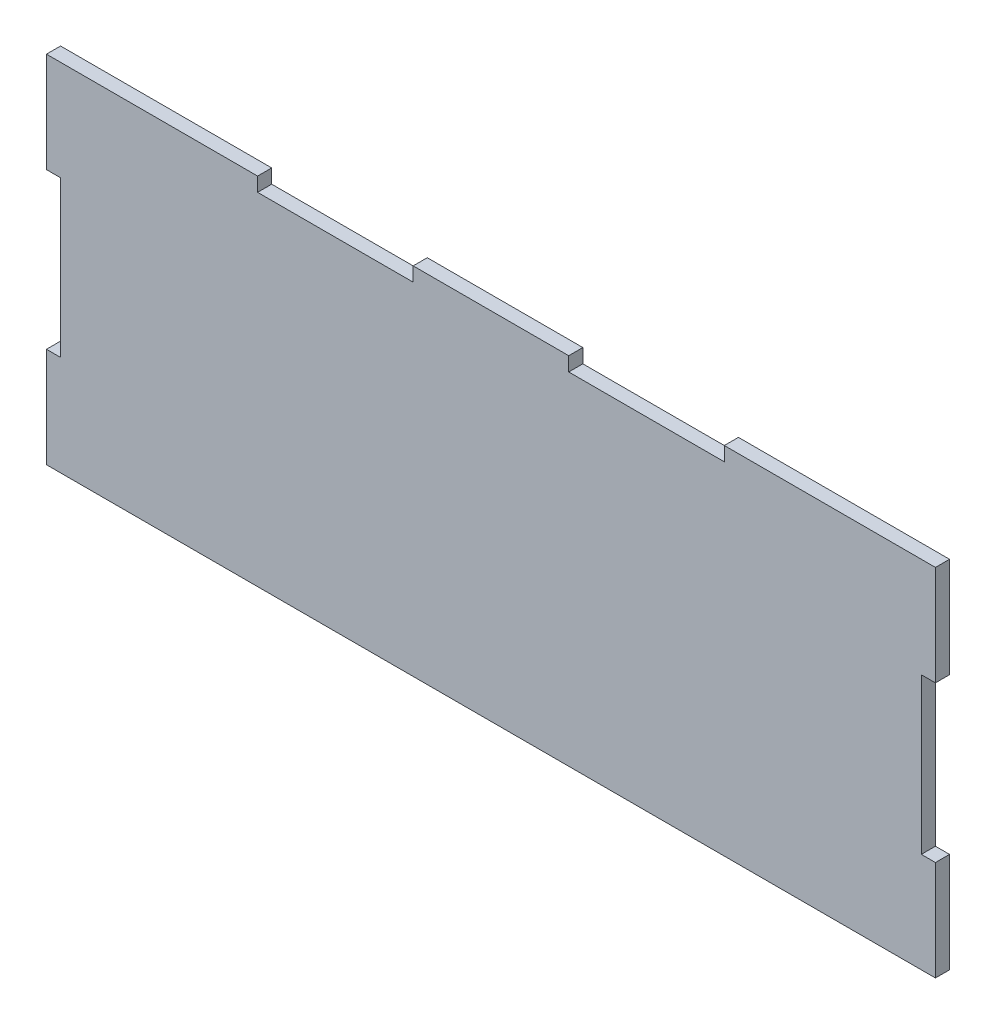
ISO-10303-21;
HEADER;
FILE_DESCRIPTION(('STEP AP214'),'2;1');
FILE_NAME('part.step','',(''),(''),'','','');
FILE_SCHEMA(('AUTOMOTIVE_DESIGN { 1 0 10303 214 1 1 1 1 }'));
ENDSEC;
DATA;
#1=APPLICATION_CONTEXT('core data for automotive mechanical design processes');
#2=APPLICATION_PROTOCOL_DEFINITION('international standard','automotive_design',2000,#1);
#3=PRODUCT_CONTEXT('',#1,'mechanical');
#4=PRODUCT('Part','Part','',(#3));
#5=PRODUCT_RELATED_PRODUCT_CATEGORY('part','',(#4));
#6=PRODUCT_DEFINITION_FORMATION('','',#4);
#7=PRODUCT_DEFINITION_CONTEXT('part definition',#1,'design');
#8=PRODUCT_DEFINITION('design','',#6,#7);
#9=PRODUCT_DEFINITION_SHAPE('','',#8);
#10=(LENGTH_UNIT() NAMED_UNIT(*) SI_UNIT(.MILLI.,.METRE.));
#11=(NAMED_UNIT(*) PLANE_ANGLE_UNIT() SI_UNIT($,.RADIAN.));
#12=(NAMED_UNIT(*) SI_UNIT($,.STERADIAN.) SOLID_ANGLE_UNIT());
#13=UNCERTAINTY_MEASURE_WITH_UNIT(LENGTH_MEASURE(1.E-05),#10,'distance_accuracy_value','');
#14=(GEOMETRIC_REPRESENTATION_CONTEXT(3) GLOBAL_UNCERTAINTY_ASSIGNED_CONTEXT((#13)) GLOBAL_UNIT_ASSIGNED_CONTEXT((#10,
#11,#12)) REPRESENTATION_CONTEXT('',''));
#15=CARTESIAN_POINT('',(0.,0.,0.));
#16=DIRECTION('',(0.,0.,1.));
#17=DIRECTION('',(1.,0.,0.));
#18=AXIS2_PLACEMENT_3D('',#15,#16,#17);
#19=CARTESIAN_POINT('',(100.,40.,3.175));
#20=DIRECTION('',(-1.,0.,0.));
#21=DIRECTION('',(0.,0.,1.));
#22=AXIS2_PLACEMENT_3D('',#19,#20,#21);
#23=PLANE('',#22);
#24=DIRECTION('',(0.,0.,1.));
#25=VECTOR('',#24,1.);
#26=CARTESIAN_POINT('',(100.,-17.5,0.));
#27=LINE('',#26,#25);
#28=CARTESIAN_POINT('',(100.,-17.5,0.));
#29=VERTEX_POINT('',#28);
#30=CARTESIAN_POINT('',(100.,-17.5,3.175));
#31=VERTEX_POINT('',#30);
#32=EDGE_CURVE('E254',#29,#31,#27,.T.);
#33=ORIENTED_EDGE('',*,*,#32,.T.);
#34=DIRECTION('',(0.,1.,0.));
#35=VECTOR('',#34,1.);
#36=CARTESIAN_POINT('',(100.,40.,3.175));
#37=LINE('',#36,#35);
#38=CARTESIAN_POINT('',(100.,-40.,3.175));
#39=VERTEX_POINT('',#38);
#40=EDGE_CURVE('E232',#39,#31,#37,.T.);
#41=ORIENTED_EDGE('',*,*,#40,.F.);
#42=DIRECTION('',(0.,0.,-1.));
#43=VECTOR('',#42,1.);
#44=CARTESIAN_POINT('',(100.,-40.,3.175));
#45=LINE('',#44,#43);
#46=CARTESIAN_POINT('',(100.,-40.,0.));
#47=VERTEX_POINT('',#46);
#48=EDGE_CURVE('E46',#39,#47,#45,.T.);
#49=ORIENTED_EDGE('',*,*,#48,.T.);
#50=DIRECTION('',(0.,1.,0.));
#51=VECTOR('',#50,1.);
#52=CARTESIAN_POINT('',(100.,40.,0.));
#53=LINE('',#52,#51);
#54=EDGE_CURVE('E202',#47,#29,#53,.T.);
#55=ORIENTED_EDGE('',*,*,#54,.T.);
#56=EDGE_LOOP('',(#33,#41,#49,#55));
#57=FACE_BOUND('',#56,.T.);
#58=ADVANCED_FACE('F37',(#57),#23,.F.);
#59=DIRECTION('',(0.,0.,1.));
#60=VECTOR('',#59,1.);
#61=CARTESIAN_POINT('',(100.,17.5,0.));
#62=LINE('',#61,#60);
#63=CARTESIAN_POINT('',(100.,17.5,0.));
#64=VERTEX_POINT('',#63);
#65=CARTESIAN_POINT('',(100.,17.5,3.175));
#66=VERTEX_POINT('',#65);
#67=EDGE_CURVE('E176',#64,#66,#62,.T.);
#68=ORIENTED_EDGE('',*,*,#67,.F.);
#69=CARTESIAN_POINT('',(100.,40.,0.));
#70=VERTEX_POINT('',#69);
#71=EDGE_CURVE('E189',#64,#70,#53,.T.);
#72=ORIENTED_EDGE('',*,*,#71,.T.);
#73=DIRECTION('',(0.,0.,-1.));
#74=VECTOR('',#73,1.);
#75=CARTESIAN_POINT('',(100.,40.,3.175));
#76=LINE('',#75,#74);
#77=CARTESIAN_POINT('',(100.,40.,3.175));
#78=VERTEX_POINT('',#77);
#79=EDGE_CURVE('E221',#78,#70,#76,.T.);
#80=ORIENTED_EDGE('',*,*,#79,.F.);
#81=EDGE_CURVE('E191',#66,#78,#37,.T.);
#82=ORIENTED_EDGE('',*,*,#81,.F.);
#83=EDGE_LOOP('',(#68,#72,#80,#82));
#84=FACE_BOUND('',#83,.T.);
#85=ADVANCED_FACE('F187',(#84),#23,.F.);
#86=CARTESIAN_POINT('',(0.,0.,3.175));
#87=DIRECTION('',(0.,0.,1.));
#88=DIRECTION('',(1.,0.,0.));
#89=AXIS2_PLACEMENT_3D('',#86,#87,#88);
#90=PLANE('',#89);
#91=ORIENTED_EDGE('',*,*,#40,.T.);
#92=DIRECTION('',(-1.,0.,0.));
#93=VECTOR('',#92,1.);
#94=CARTESIAN_POINT('',(100.,-17.5,3.175));
#95=LINE('',#94,#93);
#96=CARTESIAN_POINT('',(96.825,-17.5,3.175));
#97=VERTEX_POINT('',#96);
#98=EDGE_CURVE('E183',#31,#97,#95,.T.);
#99=ORIENTED_EDGE('',*,*,#98,.T.);
#100=DIRECTION('',(0.,1.,0.));
#101=VECTOR('',#100,1.);
#102=CARTESIAN_POINT('',(96.825,17.5,3.175));
#103=LINE('',#102,#101);
#104=CARTESIAN_POINT('',(96.825,17.5,3.175));
#105=VERTEX_POINT('',#104);
#106=EDGE_CURVE('E247',#97,#105,#103,.T.);
#107=ORIENTED_EDGE('',*,*,#106,.T.);
#108=DIRECTION('',(1.,0.,0.));
#109=VECTOR('',#108,1.);
#110=CARTESIAN_POINT('',(100.,17.5,3.175));
#111=LINE('',#110,#109);
#112=EDGE_CURVE('E244',#105,#66,#111,.T.);
#113=ORIENTED_EDGE('',*,*,#112,.T.);
#114=ORIENTED_EDGE('',*,*,#81,.T.);
#115=DIRECTION('',(-1.,0.,0.));
#116=VECTOR('',#115,1.);
#117=CARTESIAN_POINT('',(-100.,40.,3.175));
#118=LINE('',#117,#116);
#119=CARTESIAN_POINT('',(52.5,40.,3.175));
#120=VERTEX_POINT('',#119);
#121=EDGE_CURVE('E222',#78,#120,#118,.T.);
#122=ORIENTED_EDGE('',*,*,#121,.T.);
#123=DIRECTION('',(0.,1.,0.));
#124=VECTOR('',#123,1.);
#125=CARTESIAN_POINT('',(52.5,40.,3.175));
#126=LINE('',#125,#124);
#127=CARTESIAN_POINT('',(52.5,36.825,3.175));
#128=VERTEX_POINT('',#127);
#129=EDGE_CURVE('E302',#128,#120,#126,.T.);
#130=ORIENTED_EDGE('',*,*,#129,.F.);
#131=DIRECTION('',(1.,0.,0.));
#132=VECTOR('',#131,1.);
#133=CARTESIAN_POINT('',(17.5,36.825,3.175));
#134=LINE('',#133,#132);
#135=CARTESIAN_POINT('',(17.5,36.825,3.175));
#136=VERTEX_POINT('',#135);
#137=EDGE_CURVE('E314',#136,#128,#134,.T.);
#138=ORIENTED_EDGE('',*,*,#137,.F.);
#139=DIRECTION('',(0.,-1.,0.));
#140=VECTOR('',#139,1.);
#141=CARTESIAN_POINT('',(17.5,40.,3.175));
#142=LINE('',#141,#140);
#143=CARTESIAN_POINT('',(17.5,40.,3.175));
#144=VERTEX_POINT('',#143);
#145=EDGE_CURVE('E310',#144,#136,#142,.T.);
#146=ORIENTED_EDGE('',*,*,#145,.F.);
#147=CARTESIAN_POINT('',(-17.5,40.,3.175));
#148=VERTEX_POINT('',#147);
#149=EDGE_CURVE('E380',#144,#148,#118,.T.);
#150=ORIENTED_EDGE('',*,*,#149,.T.);
#151=DIRECTION('',(0.,1.,0.));
#152=VECTOR('',#151,1.);
#153=CARTESIAN_POINT('',(-17.5,40.,3.175));
#154=LINE('',#153,#152);
#155=CARTESIAN_POINT('',(-17.5,36.825,3.175));
#156=VERTEX_POINT('',#155);
#157=EDGE_CURVE('E288',#156,#148,#154,.T.);
#158=ORIENTED_EDGE('',*,*,#157,.F.);
#159=DIRECTION('',(1.,0.,0.));
#160=VECTOR('',#159,1.);
#161=CARTESIAN_POINT('',(-17.5,36.825,3.175));
#162=LINE('',#161,#160);
#163=CARTESIAN_POINT('',(-52.5,36.825,3.175));
#164=VERTEX_POINT('',#163);
#165=EDGE_CURVE('E339',#164,#156,#162,.T.);
#166=ORIENTED_EDGE('',*,*,#165,.F.);
#167=DIRECTION('',(0.,-1.,0.));
#168=VECTOR('',#167,1.);
#169=CARTESIAN_POINT('',(-52.5,40.,3.175));
#170=LINE('',#169,#168);
#171=CARTESIAN_POINT('',(-52.5,40.,3.175));
#172=VERTEX_POINT('',#171);
#173=EDGE_CURVE('E350',#172,#164,#170,.T.);
#174=ORIENTED_EDGE('',*,*,#173,.F.);
#175=CARTESIAN_POINT('',(-100.,40.,3.175));
#176=VERTEX_POINT('',#175);
#177=EDGE_CURVE('E377',#172,#176,#118,.T.);
#178=ORIENTED_EDGE('',*,*,#177,.T.);
#179=DIRECTION('',(0.,-1.,0.));
#180=VECTOR('',#179,1.);
#181=CARTESIAN_POINT('',(-100.,40.,3.175));
#182=LINE('',#181,#180);
#183=CARTESIAN_POINT('',(-100.,17.5,3.175));
#184=VERTEX_POINT('',#183);
#185=EDGE_CURVE('E368',#176,#184,#182,.T.);
#186=ORIENTED_EDGE('',*,*,#185,.T.);
#187=DIRECTION('',(-1.,0.,0.));
#188=VECTOR('',#187,1.);
#189=CARTESIAN_POINT('',(-100.,17.5,3.175));
#190=LINE('',#189,#188);
#191=CARTESIAN_POINT('',(-96.825,17.5,3.175));
#192=VERTEX_POINT('',#191);
#193=EDGE_CURVE('E267',#192,#184,#190,.T.);
#194=ORIENTED_EDGE('',*,*,#193,.F.);
#195=DIRECTION('',(0.,1.,0.));
#196=VECTOR('',#195,1.);
#197=CARTESIAN_POINT('',(-96.825,17.5,3.175));
#198=LINE('',#197,#196);
#199=CARTESIAN_POINT('',(-96.825,-17.5,3.175));
#200=VERTEX_POINT('',#199);
#201=EDGE_CURVE('E278',#200,#192,#198,.T.);
#202=ORIENTED_EDGE('',*,*,#201,.F.);
#203=DIRECTION('',(1.,0.,0.));
#204=VECTOR('',#203,1.);
#205=CARTESIAN_POINT('',(-100.,-17.5,3.175));
#206=LINE('',#205,#204);
#207=CARTESIAN_POINT('',(-100.,-17.5,3.175));
#208=VERTEX_POINT('',#207);
#209=EDGE_CURVE('E257',#208,#200,#206,.T.);
#210=ORIENTED_EDGE('',*,*,#209,.F.);
#211=CARTESIAN_POINT('',(-100.,-40.,3.175));
#212=VERTEX_POINT('',#211);
#213=EDGE_CURVE('E215',#208,#212,#182,.T.);
#214=ORIENTED_EDGE('',*,*,#213,.T.);
#215=DIRECTION('',(1.,0.,0.));
#216=VECTOR('',#215,1.);
#217=CARTESIAN_POINT('',(-100.,-40.,3.175));
#218=LINE('',#217,#216);
#219=EDGE_CURVE('E372',#212,#39,#218,.T.);
#220=ORIENTED_EDGE('',*,*,#219,.T.);
#221=EDGE_LOOP('',(#91,#99,#107,#113,#114,#122,#130,#138,#146,#150,#158,#166,#174,#178,#186,
#194,#202,#210,#214,#220));
#222=FACE_BOUND('',#221,.T.);
#223=ADVANCED_FACE('F398',(#222),#90,.T.);
#224=CARTESIAN_POINT('',(0.,0.,0.));
#225=DIRECTION('',(0.,0.,1.));
#226=DIRECTION('',(1.,0.,0.));
#227=AXIS2_PLACEMENT_3D('',#224,#225,#226);
#228=PLANE('',#227);
#229=DIRECTION('',(-1.,0.,0.));
#230=VECTOR('',#229,1.);
#231=CARTESIAN_POINT('',(100.,-17.5,0.));
#232=LINE('',#231,#230);
#233=CARTESIAN_POINT('',(96.825,-17.5,0.));
#234=VERTEX_POINT('',#233);
#235=EDGE_CURVE('E193',#29,#234,#232,.T.);
#236=ORIENTED_EDGE('',*,*,#235,.F.);
#237=ORIENTED_EDGE('',*,*,#54,.F.);
#238=DIRECTION('',(1.,0.,0.));
#239=VECTOR('',#238,1.);
#240=CARTESIAN_POINT('',(-100.,-40.,0.));
#241=LINE('',#240,#239);
#242=CARTESIAN_POINT('',(-100.,-40.,0.));
#243=VERTEX_POINT('',#242);
#244=EDGE_CURVE('E203',#243,#47,#241,.T.);
#245=ORIENTED_EDGE('',*,*,#244,.F.);
#246=DIRECTION('',(0.,-1.,0.));
#247=VECTOR('',#246,1.);
#248=CARTESIAN_POINT('',(-100.,40.,0.));
#249=LINE('',#248,#247);
#250=CARTESIAN_POINT('',(-100.,-17.5,0.));
#251=VERTEX_POINT('',#250);
#252=EDGE_CURVE('E324',#251,#243,#249,.T.);
#253=ORIENTED_EDGE('',*,*,#252,.F.);
#254=DIRECTION('',(1.,0.,0.));
#255=VECTOR('',#254,1.);
#256=CARTESIAN_POINT('',(-100.,-17.5,0.));
#257=LINE('',#256,#255);
#258=CARTESIAN_POINT('',(-96.825,-17.5,0.));
#259=VERTEX_POINT('',#258);
#260=EDGE_CURVE('E263',#251,#259,#257,.T.);
#261=ORIENTED_EDGE('',*,*,#260,.T.);
#262=DIRECTION('',(0.,1.,0.));
#263=VECTOR('',#262,1.);
#264=CARTESIAN_POINT('',(-96.825,17.5,0.));
#265=LINE('',#264,#263);
#266=CARTESIAN_POINT('',(-96.825,17.5,0.));
#267=VERTEX_POINT('',#266);
#268=EDGE_CURVE('E61',#259,#267,#265,.T.);
#269=ORIENTED_EDGE('',*,*,#268,.T.);
#270=DIRECTION('',(-1.,0.,0.));
#271=VECTOR('',#270,1.);
#272=CARTESIAN_POINT('',(-100.,17.5,0.));
#273=LINE('',#272,#271);
#274=CARTESIAN_POINT('',(-100.,17.5,0.));
#275=VERTEX_POINT('',#274);
#276=EDGE_CURVE('E270',#267,#275,#273,.T.);
#277=ORIENTED_EDGE('',*,*,#276,.T.);
#278=CARTESIAN_POINT('',(-100.,40.,0.));
#279=VERTEX_POINT('',#278);
#280=EDGE_CURVE('E209',#279,#275,#249,.T.);
#281=ORIENTED_EDGE('',*,*,#280,.F.);
#282=DIRECTION('',(-1.,0.,0.));
#283=VECTOR('',#282,1.);
#284=CARTESIAN_POINT('',(-100.,40.,0.));
#285=LINE('',#284,#283);
#286=CARTESIAN_POINT('',(-52.5,40.,0.));
#287=VERTEX_POINT('',#286);
#288=EDGE_CURVE('E208',#287,#279,#285,.T.);
#289=ORIENTED_EDGE('',*,*,#288,.F.);
#290=DIRECTION('',(0.,-1.,0.));
#291=VECTOR('',#290,1.);
#292=CARTESIAN_POINT('',(-52.5,40.,0.));
#293=LINE('',#292,#291);
#294=CARTESIAN_POINT('',(-52.5,36.825,0.));
#295=VERTEX_POINT('',#294);
#296=EDGE_CURVE('E338',#287,#295,#293,.T.);
#297=ORIENTED_EDGE('',*,*,#296,.T.);
#298=DIRECTION('',(1.,0.,0.));
#299=VECTOR('',#298,1.);
#300=CARTESIAN_POINT('',(-17.5,36.825,0.));
#301=LINE('',#300,#299);
#302=CARTESIAN_POINT('',(-17.5,36.825,0.));
#303=VERTEX_POINT('',#302);
#304=EDGE_CURVE('E343',#295,#303,#301,.T.);
#305=ORIENTED_EDGE('',*,*,#304,.T.);
#306=DIRECTION('',(0.,1.,0.));
#307=VECTOR('',#306,1.);
#308=CARTESIAN_POINT('',(-17.5,40.,0.));
#309=LINE('',#308,#307);
#310=CARTESIAN_POINT('',(-17.5,40.,0.));
#311=VERTEX_POINT('',#310);
#312=EDGE_CURVE('E334',#303,#311,#309,.T.);
#313=ORIENTED_EDGE('',*,*,#312,.T.);
#314=CARTESIAN_POINT('',(17.5,40.,0.));
#315=VERTEX_POINT('',#314);
#316=EDGE_CURVE('E216',#315,#311,#285,.T.);
#317=ORIENTED_EDGE('',*,*,#316,.F.);
#318=DIRECTION('',(0.,-1.,0.));
#319=VECTOR('',#318,1.);
#320=CARTESIAN_POINT('',(17.5,40.,0.));
#321=LINE('',#320,#319);
#322=CARTESIAN_POINT('',(17.5,36.825,0.));
#323=VERTEX_POINT('',#322);
#324=EDGE_CURVE('E297',#315,#323,#321,.T.);
#325=ORIENTED_EDGE('',*,*,#324,.T.);
#326=DIRECTION('',(1.,0.,0.));
#327=VECTOR('',#326,1.);
#328=CARTESIAN_POINT('',(17.5,36.825,0.));
#329=LINE('',#328,#327);
#330=CARTESIAN_POINT('',(52.5,36.825,0.));
#331=VERTEX_POINT('',#330);
#332=EDGE_CURVE('E301',#323,#331,#329,.T.);
#333=ORIENTED_EDGE('',*,*,#332,.T.);
#334=DIRECTION('',(0.,1.,0.));
#335=VECTOR('',#334,1.);
#336=CARTESIAN_POINT('',(52.5,40.,0.));
#337=LINE('',#336,#335);
#338=CARTESIAN_POINT('',(52.5,40.,0.));
#339=VERTEX_POINT('',#338);
#340=EDGE_CURVE('E306',#331,#339,#337,.T.);
#341=ORIENTED_EDGE('',*,*,#340,.T.);
#342=EDGE_CURVE('E200',#70,#339,#285,.T.);
#343=ORIENTED_EDGE('',*,*,#342,.F.);
#344=ORIENTED_EDGE('',*,*,#71,.F.);
#345=DIRECTION('',(1.,0.,0.));
#346=VECTOR('',#345,1.);
#347=CARTESIAN_POINT('',(100.,17.5,0.));
#348=LINE('',#347,#346);
#349=CARTESIAN_POINT('',(96.825,17.5,0.));
#350=VERTEX_POINT('',#349);
#351=EDGE_CURVE('E173',#350,#64,#348,.T.);
#352=ORIENTED_EDGE('',*,*,#351,.F.);
#353=DIRECTION('',(0.,1.,0.));
#354=VECTOR('',#353,1.);
#355=CARTESIAN_POINT('',(96.825,17.5,0.));
#356=LINE('',#355,#354);
#357=EDGE_CURVE('E182',#234,#350,#356,.T.);
#358=ORIENTED_EDGE('',*,*,#357,.F.);
#359=EDGE_LOOP('',(#236,#237,#245,#253,#261,#269,#277,#281,#289,#297,#305,#313,#317,#325,#333,
#341,#343,#344,#352,#358));
#360=FACE_BOUND('',#359,.T.);
#361=ADVANCED_FACE('F197',(#360),#228,.F.);
#362=CARTESIAN_POINT('',(-100.,40.,3.175));
#363=DIRECTION('',(1.,0.,0.));
#364=DIRECTION('',(0.,0.,-1.));
#365=AXIS2_PLACEMENT_3D('',#362,#363,#364);
#366=PLANE('',#365);
#367=ORIENTED_EDGE('',*,*,#280,.T.);
#368=DIRECTION('',(0.,0.,1.));
#369=VECTOR('',#368,1.);
#370=CARTESIAN_POINT('',(-100.,17.5,0.));
#371=LINE('',#370,#369);
#372=EDGE_CURVE('E284',#275,#184,#371,.T.);
#373=ORIENTED_EDGE('',*,*,#372,.T.);
#374=ORIENTED_EDGE('',*,*,#185,.F.);
#375=DIRECTION('',(0.,0.,-1.));
#376=VECTOR('',#375,1.);
#377=CARTESIAN_POINT('',(-100.,40.,3.175));
#378=LINE('',#377,#376);
#379=EDGE_CURVE('E217',#176,#279,#378,.T.);
#380=ORIENTED_EDGE('',*,*,#379,.T.);
#381=EDGE_LOOP('',(#367,#373,#374,#380));
#382=FACE_BOUND('',#381,.T.);
#383=ADVANCED_FACE('F402',(#382),#366,.F.);
#384=CARTESIAN_POINT('',(-100.,40.,3.175));
#385=DIRECTION('',(0.,-1.,0.));
#386=DIRECTION('',(0.,0.,-1.));
#387=AXIS2_PLACEMENT_3D('',#384,#385,#386);
#388=PLANE('',#387);
#389=ORIENTED_EDGE('',*,*,#149,.F.);
#390=DIRECTION('',(0.,0.,1.));
#391=VECTOR('',#390,1.);
#392=CARTESIAN_POINT('',(17.5,40.,0.));
#393=LINE('',#392,#391);
#394=EDGE_CURVE('E321',#315,#144,#393,.T.);
#395=ORIENTED_EDGE('',*,*,#394,.F.);
#396=ORIENTED_EDGE('',*,*,#316,.T.);
#397=DIRECTION('',(0.,0.,1.));
#398=VECTOR('',#397,1.);
#399=CARTESIAN_POINT('',(-17.5,40.,0.));
#400=LINE('',#399,#398);
#401=EDGE_CURVE('E347',#311,#148,#400,.T.);
#402=ORIENTED_EDGE('',*,*,#401,.T.);
#403=EDGE_LOOP('',(#389,#395,#396,#402));
#404=FACE_BOUND('',#403,.T.);
#405=ADVANCED_FACE('F415',(#404),#388,.F.);
#406=ORIENTED_EDGE('',*,*,#342,.T.);
#407=DIRECTION('',(0.,0.,1.));
#408=VECTOR('',#407,1.);
#409=CARTESIAN_POINT('',(52.5,40.,0.));
#410=LINE('',#409,#408);
#411=EDGE_CURVE('E325',#339,#120,#410,.T.);
#412=ORIENTED_EDGE('',*,*,#411,.T.);
#413=ORIENTED_EDGE('',*,*,#121,.F.);
#414=ORIENTED_EDGE('',*,*,#79,.T.);
#415=EDGE_LOOP('',(#406,#412,#413,#414));
#416=FACE_BOUND('',#415,.T.);
#417=ADVANCED_FACE('F456',(#416),#388,.F.);
#418=ORIENTED_EDGE('',*,*,#213,.F.);
#419=DIRECTION('',(0.,0.,1.));
#420=VECTOR('',#419,1.);
#421=CARTESIAN_POINT('',(-100.,-17.5,0.));
#422=LINE('',#421,#420);
#423=EDGE_CURVE('E274',#251,#208,#422,.T.);
#424=ORIENTED_EDGE('',*,*,#423,.F.);
#425=ORIENTED_EDGE('',*,*,#252,.T.);
#426=DIRECTION('',(0.,0.,-1.));
#427=VECTOR('',#426,1.);
#428=CARTESIAN_POINT('',(-100.,-40.,3.175));
#429=LINE('',#428,#427);
#430=EDGE_CURVE('E11',#212,#243,#429,.T.);
#431=ORIENTED_EDGE('',*,*,#430,.F.);
#432=EDGE_LOOP('',(#418,#424,#425,#431));
#433=FACE_BOUND('',#432,.T.);
#434=ADVANCED_FACE('F39',(#433),#366,.F.);
#435=CARTESIAN_POINT('',(-100.,-40.,3.175));
#436=DIRECTION('',(0.,1.,0.));
#437=DIRECTION('',(-1.,0.,0.));
#438=AXIS2_PLACEMENT_3D('',#435,#436,#437);
#439=PLANE('',#438);
#440=ORIENTED_EDGE('',*,*,#244,.T.);
#441=ORIENTED_EDGE('',*,*,#48,.F.);
#442=ORIENTED_EDGE('',*,*,#219,.F.);
#443=ORIENTED_EDGE('',*,*,#430,.T.);
#444=EDGE_LOOP('',(#440,#441,#442,#443));
#445=FACE_BOUND('',#444,.T.);
#446=ADVANCED_FACE('F450',(#445),#439,.F.);
#447=ORIENTED_EDGE('',*,*,#177,.F.);
#448=DIRECTION('',(0.,0.,1.));
#449=VECTOR('',#448,1.);
#450=CARTESIAN_POINT('',(-52.5,40.,0.));
#451=LINE('',#450,#449);
#452=EDGE_CURVE('E362',#287,#172,#451,.T.);
#453=ORIENTED_EDGE('',*,*,#452,.F.);
#454=ORIENTED_EDGE('',*,*,#288,.T.);
#455=ORIENTED_EDGE('',*,*,#379,.F.);
#456=EDGE_LOOP('',(#447,#453,#454,#455));
#457=FACE_BOUND('',#456,.T.);
#458=ADVANCED_FACE('F427',(#457),#388,.F.);
#459=CARTESIAN_POINT('',(-17.5,40.,0.));
#460=DIRECTION('',(1.,0.,0.));
#461=DIRECTION('',(0.,1.,0.));
#462=AXIS2_PLACEMENT_3D('',#459,#460,#461);
#463=PLANE('',#462);
#464=ORIENTED_EDGE('',*,*,#157,.T.);
#465=ORIENTED_EDGE('',*,*,#401,.F.);
#466=ORIENTED_EDGE('',*,*,#312,.F.);
#467=DIRECTION('',(0.,0.,1.));
#468=VECTOR('',#467,1.);
#469=CARTESIAN_POINT('',(-17.5,36.825,0.));
#470=LINE('',#469,#468);
#471=EDGE_CURVE('E315',#303,#156,#470,.T.);
#472=ORIENTED_EDGE('',*,*,#471,.T.);
#473=EDGE_LOOP('',(#464,#465,#466,#472));
#474=FACE_BOUND('',#473,.T.);
#475=ADVANCED_FACE('F419',(#474),#463,.F.);
#476=CARTESIAN_POINT('',(-17.5,36.825,0.));
#477=DIRECTION('',(0.,-1.,0.));
#478=DIRECTION('',(0.,0.,-1.));
#479=AXIS2_PLACEMENT_3D('',#476,#477,#478);
#480=PLANE('',#479);
#481=ORIENTED_EDGE('',*,*,#165,.T.);
#482=ORIENTED_EDGE('',*,*,#471,.F.);
#483=ORIENTED_EDGE('',*,*,#304,.F.);
#484=DIRECTION('',(0.,0.,1.));
#485=VECTOR('',#484,1.);
#486=CARTESIAN_POINT('',(-52.5,36.825,0.));
#487=LINE('',#486,#485);
#488=EDGE_CURVE('E359',#295,#164,#487,.T.);
#489=ORIENTED_EDGE('',*,*,#488,.T.);
#490=EDGE_LOOP('',(#481,#482,#483,#489));
#491=FACE_BOUND('',#490,.T.);
#492=ADVANCED_FACE('F432',(#491),#480,.F.);
#493=CARTESIAN_POINT('',(-52.5,40.,0.));
#494=DIRECTION('',(-1.,0.,0.));
#495=DIRECTION('',(0.,-1.,0.));
#496=AXIS2_PLACEMENT_3D('',#493,#494,#495);
#497=PLANE('',#496);
#498=ORIENTED_EDGE('',*,*,#173,.T.);
#499=ORIENTED_EDGE('',*,*,#488,.F.);
#500=ORIENTED_EDGE('',*,*,#296,.F.);
#501=ORIENTED_EDGE('',*,*,#452,.T.);
#502=EDGE_LOOP('',(#498,#499,#500,#501));
#503=FACE_BOUND('',#502,.T.);
#504=ADVANCED_FACE('F429',(#503),#497,.F.);
#505=CARTESIAN_POINT('',(17.5,40.,0.));
#506=DIRECTION('',(-1.,0.,0.));
#507=DIRECTION('',(0.,-1.,0.));
#508=AXIS2_PLACEMENT_3D('',#505,#506,#507);
#509=PLANE('',#508);
#510=ORIENTED_EDGE('',*,*,#145,.T.);
#511=DIRECTION('',(0.,0.,1.));
#512=VECTOR('',#511,1.);
#513=CARTESIAN_POINT('',(17.5,36.825,0.));
#514=LINE('',#513,#512);
#515=EDGE_CURVE('E309',#323,#136,#514,.T.);
#516=ORIENTED_EDGE('',*,*,#515,.F.);
#517=ORIENTED_EDGE('',*,*,#324,.F.);
#518=ORIENTED_EDGE('',*,*,#394,.T.);
#519=EDGE_LOOP('',(#510,#516,#517,#518));
#520=FACE_BOUND('',#519,.T.);
#521=ADVANCED_FACE('F439',(#520),#509,.F.);
#522=CARTESIAN_POINT('',(52.5,40.,0.));
#523=DIRECTION('',(1.,0.,0.));
#524=DIRECTION('',(0.,0.,-1.));
#525=AXIS2_PLACEMENT_3D('',#522,#523,#524);
#526=PLANE('',#525);
#527=ORIENTED_EDGE('',*,*,#129,.T.);
#528=ORIENTED_EDGE('',*,*,#411,.F.);
#529=ORIENTED_EDGE('',*,*,#340,.F.);
#530=DIRECTION('',(0.,0.,1.));
#531=VECTOR('',#530,1.);
#532=CARTESIAN_POINT('',(52.5,36.825,0.));
#533=LINE('',#532,#531);
#534=EDGE_CURVE('E329',#331,#128,#533,.T.);
#535=ORIENTED_EDGE('',*,*,#534,.T.);
#536=EDGE_LOOP('',(#527,#528,#529,#535));
#537=FACE_BOUND('',#536,.T.);
#538=ADVANCED_FACE('F463',(#537),#526,.F.);
#539=CARTESIAN_POINT('',(17.5,36.825,0.));
#540=DIRECTION('',(0.,-1.,0.));
#541=DIRECTION('',(0.,0.,-1.));
#542=AXIS2_PLACEMENT_3D('',#539,#540,#541);
#543=PLANE('',#542);
#544=ORIENTED_EDGE('',*,*,#137,.T.);
#545=ORIENTED_EDGE('',*,*,#534,.F.);
#546=ORIENTED_EDGE('',*,*,#332,.F.);
#547=ORIENTED_EDGE('',*,*,#515,.T.);
#548=EDGE_LOOP('',(#544,#545,#546,#547));
#549=FACE_BOUND('',#548,.T.);
#550=ADVANCED_FACE('F467',(#549),#543,.F.);
#551=CARTESIAN_POINT('',(-100.,17.5,0.));
#552=DIRECTION('',(0.,1.,0.));
#553=DIRECTION('',(0.,0.,1.));
#554=AXIS2_PLACEMENT_3D('',#551,#552,#553);
#555=PLANE('',#554);
#556=ORIENTED_EDGE('',*,*,#193,.T.);
#557=ORIENTED_EDGE('',*,*,#372,.F.);
#558=ORIENTED_EDGE('',*,*,#276,.F.);
#559=DIRECTION('',(0.,0.,1.));
#560=VECTOR('',#559,1.);
#561=CARTESIAN_POINT('',(-96.825,17.5,0.));
#562=LINE('',#561,#560);
#563=EDGE_CURVE('E289',#267,#192,#562,.T.);
#564=ORIENTED_EDGE('',*,*,#563,.T.);
#565=EDGE_LOOP('',(#556,#557,#558,#564));
#566=FACE_BOUND('',#565,.T.);
#567=ADVANCED_FACE('F401',(#566),#555,.F.);
#568=CARTESIAN_POINT('',(-96.825,17.5,0.));
#569=DIRECTION('',(1.,0.,0.));
#570=DIRECTION('',(0.,0.,-1.));
#571=AXIS2_PLACEMENT_3D('',#568,#569,#570);
#572=PLANE('',#571);
#573=ORIENTED_EDGE('',*,*,#201,.T.);
#574=ORIENTED_EDGE('',*,*,#563,.F.);
#575=ORIENTED_EDGE('',*,*,#268,.F.);
#576=DIRECTION('',(0.,0.,1.));
#577=VECTOR('',#576,1.);
#578=CARTESIAN_POINT('',(-96.825,-17.5,0.));
#579=LINE('',#578,#577);
#580=EDGE_CURVE('E292',#259,#200,#579,.T.);
#581=ORIENTED_EDGE('',*,*,#580,.T.);
#582=EDGE_LOOP('',(#573,#574,#575,#581));
#583=FACE_BOUND('',#582,.T.);
#584=ADVANCED_FACE('F394',(#583),#572,.F.);
#585=CARTESIAN_POINT('',(-100.,-17.5,0.));
#586=DIRECTION('',(0.,-1.,0.));
#587=DIRECTION('',(0.,0.,-1.));
#588=AXIS2_PLACEMENT_3D('',#585,#586,#587);
#589=PLANE('',#588);
#590=ORIENTED_EDGE('',*,*,#209,.T.);
#591=ORIENTED_EDGE('',*,*,#580,.F.);
#592=ORIENTED_EDGE('',*,*,#260,.F.);
#593=ORIENTED_EDGE('',*,*,#423,.T.);
#594=EDGE_LOOP('',(#590,#591,#592,#593));
#595=FACE_BOUND('',#594,.T.);
#596=ADVANCED_FACE('F391',(#595),#589,.F.);
#597=CARTESIAN_POINT('',(100.,-17.5,0.));
#598=DIRECTION('',(0.,1.,0.));
#599=DIRECTION('',(0.,0.,1.));
#600=AXIS2_PLACEMENT_3D('',#597,#598,#599);
#601=PLANE('',#600);
#602=ORIENTED_EDGE('',*,*,#98,.F.);
#603=ORIENTED_EDGE('',*,*,#32,.F.);
#604=ORIENTED_EDGE('',*,*,#235,.T.);
#605=DIRECTION('',(0.,0.,1.));
#606=VECTOR('',#605,1.);
#607=CARTESIAN_POINT('',(96.825,-17.5,0.));
#608=LINE('',#607,#606);
#609=EDGE_CURVE('E258',#234,#97,#608,.T.);
#610=ORIENTED_EDGE('',*,*,#609,.T.);
#611=EDGE_LOOP('',(#602,#603,#604,#610));
#612=FACE_BOUND('',#611,.T.);
#613=ADVANCED_FACE('F479',(#612),#601,.T.);
#614=CARTESIAN_POINT('',(96.825,17.5,0.));
#615=DIRECTION('',(1.,0.,0.));
#616=DIRECTION('',(0.,0.,-1.));
#617=AXIS2_PLACEMENT_3D('',#614,#615,#616);
#618=PLANE('',#617);
#619=ORIENTED_EDGE('',*,*,#106,.F.);
#620=ORIENTED_EDGE('',*,*,#609,.F.);
#621=ORIENTED_EDGE('',*,*,#357,.T.);
#622=DIRECTION('',(0.,0.,1.));
#623=VECTOR('',#622,1.);
#624=CARTESIAN_POINT('',(96.825,17.5,0.));
#625=LINE('',#624,#623);
#626=EDGE_CURVE('E53',#350,#105,#625,.T.);
#627=ORIENTED_EDGE('',*,*,#626,.T.);
#628=EDGE_LOOP('',(#619,#620,#621,#627));
#629=FACE_BOUND('',#628,.T.);
#630=ADVANCED_FACE('F486',(#629),#618,.T.);
#631=CARTESIAN_POINT('',(100.,17.5,0.));
#632=DIRECTION('',(0.,-1.,0.));
#633=DIRECTION('',(0.,0.,-1.));
#634=AXIS2_PLACEMENT_3D('',#631,#632,#633);
#635=PLANE('',#634);
#636=ORIENTED_EDGE('',*,*,#112,.F.);
#637=ORIENTED_EDGE('',*,*,#626,.F.);
#638=ORIENTED_EDGE('',*,*,#351,.T.);
#639=ORIENTED_EDGE('',*,*,#67,.T.);
#640=EDGE_LOOP('',(#636,#637,#638,#639));
#641=FACE_BOUND('',#640,.T.);
#642=ADVANCED_FACE('F175',(#641),#635,.T.);
#643=CLOSED_SHELL('',(#58,#85,#223,#361,#383,#405,#417,#434,#446,#458,#475,#492,#504,#521,#538,
#550,#567,#584,#596,#613,#630,#642));
#644=MANIFOLD_SOLID_BREP('B2',#643);
#645=ADVANCED_BREP_SHAPE_REPRESENTATION('',(#18,#644),#14);
#646=SHAPE_DEFINITION_REPRESENTATION(#9,#645);
ENDSEC;
END-ISO-10303-21;
